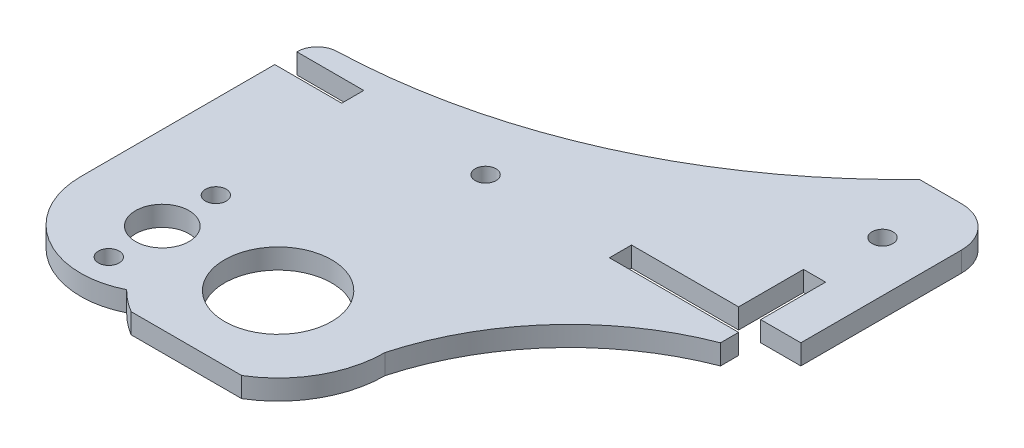
ISO-10303-21;
HEADER;
FILE_DESCRIPTION(('STEP AP214'),'2;1');
FILE_NAME('part.step','',(''),(''),'','','');
FILE_SCHEMA(('AUTOMOTIVE_DESIGN { 1 0 10303 214 1 1 1 1 }'));
ENDSEC;
DATA;
#1=APPLICATION_CONTEXT('core data for automotive mechanical design processes');
#2=APPLICATION_PROTOCOL_DEFINITION('international standard','automotive_design',2000,#1);
#3=PRODUCT_CONTEXT('',#1,'mechanical');
#4=PRODUCT('Part','Part','',(#3));
#5=PRODUCT_RELATED_PRODUCT_CATEGORY('part','',(#4));
#6=PRODUCT_DEFINITION_FORMATION('','',#4);
#7=PRODUCT_DEFINITION_CONTEXT('part definition',#1,'design');
#8=PRODUCT_DEFINITION('design','',#6,#7);
#9=PRODUCT_DEFINITION_SHAPE('','',#8);
#10=(LENGTH_UNIT() NAMED_UNIT(*) SI_UNIT(.MILLI.,.METRE.));
#11=(NAMED_UNIT(*) PLANE_ANGLE_UNIT() SI_UNIT($,.RADIAN.));
#12=(NAMED_UNIT(*) SI_UNIT($,.STERADIAN.) SOLID_ANGLE_UNIT());
#13=UNCERTAINTY_MEASURE_WITH_UNIT(LENGTH_MEASURE(1.E-05),#10,'distance_accuracy_value','');
#14=(GEOMETRIC_REPRESENTATION_CONTEXT(3) GLOBAL_UNCERTAINTY_ASSIGNED_CONTEXT((#13)) GLOBAL_UNIT_ASSIGNED_CONTEXT((#10,
#11,#12)) REPRESENTATION_CONTEXT('',''));
#15=CARTESIAN_POINT('',(0.,0.,0.));
#16=DIRECTION('',(0.,0.,1.));
#17=DIRECTION('',(1.,0.,0.));
#18=AXIS2_PLACEMENT_3D('',#15,#16,#17);
#19=CARTESIAN_POINT('',(0.,3.,4.));
#20=DIRECTION('',(0.,0.,-1.));
#21=DIRECTION('',(-1.,0.,0.));
#22=AXIS2_PLACEMENT_3D('',#19,#20,#21);
#23=PLANE('',#22);
#24=DIRECTION('',(0.,1.,0.));
#25=VECTOR('',#24,1.);
#26=CARTESIAN_POINT('',(37.7649863883907,-109.718638790317,4.));
#27=LINE('',#26,#25);
#28=CARTESIAN_POINT('',(37.7649863883907,0.,4.));
#29=VERTEX_POINT('',#28);
#30=CARTESIAN_POINT('',(37.7649863883907,3.,4.));
#31=VERTEX_POINT('',#30);
#32=EDGE_CURVE('E335',#29,#31,#27,.T.);
#33=ORIENTED_EDGE('',*,*,#32,.T.);
#34=DIRECTION('',(1.,0.,0.));
#35=VECTOR('',#34,1.);
#36=CARTESIAN_POINT('',(0.,3.,4.));
#37=LINE('',#36,#35);
#38=CARTESIAN_POINT('',(21.2350136116387,3.,4.));
#39=VERTEX_POINT('',#38);
#40=EDGE_CURVE('E333',#39,#31,#37,.T.);
#41=ORIENTED_EDGE('',*,*,#40,.F.);
#42=DIRECTION('',(0.,1.,0.));
#43=VECTOR('',#42,1.);
#44=CARTESIAN_POINT('',(21.2350136116387,-109.718638790317,4.));
#45=LINE('',#44,#43);
#46=CARTESIAN_POINT('',(21.2350136116387,0.,4.));
#47=VERTEX_POINT('',#46);
#48=EDGE_CURVE('E336',#47,#39,#45,.T.);
#49=ORIENTED_EDGE('',*,*,#48,.F.);
#50=DIRECTION('',(1.,0.,0.));
#51=VECTOR('',#50,1.);
#52=CARTESIAN_POINT('',(0.,0.,4.));
#53=LINE('',#52,#51);
#54=EDGE_CURVE('E436',#47,#29,#53,.T.);
#55=ORIENTED_EDGE('',*,*,#54,.T.);
#56=EDGE_LOOP('',(#33,#41,#49,#55));
#57=FACE_BOUND('',#56,.T.);
#58=ADVANCED_FACE('F115',(#57),#23,.F.);
#59=CARTESIAN_POINT('',(69.3,3.,0.));
#60=DIRECTION('',(-1.,0.,0.));
#61=DIRECTION('',(0.,0.,1.));
#62=AXIS2_PLACEMENT_3D('',#59,#60,#61);
#63=PLANE('',#62);
#64=DIRECTION('',(0.,1.,0.));
#65=VECTOR('',#64,1.);
#66=CARTESIAN_POINT('',(69.3,-109.718638790317,-36.));
#67=LINE('',#66,#65);
#68=CARTESIAN_POINT('',(69.3,0.,-36.));
#69=VERTEX_POINT('',#68);
#70=CARTESIAN_POINT('',(69.3,3.,-36.));
#71=VERTEX_POINT('',#70);
#72=EDGE_CURVE('E319',#69,#71,#67,.T.);
#73=ORIENTED_EDGE('',*,*,#72,.F.);
#74=DIRECTION('',(0.,0.,-1.));
#75=VECTOR('',#74,1.);
#76=CARTESIAN_POINT('',(69.3,0.,0.));
#77=LINE('',#76,#75);
#78=CARTESIAN_POINT('',(69.3,0.,-38.7));
#79=VERTEX_POINT('',#78);
#80=EDGE_CURVE('E491',#69,#79,#77,.T.);
#81=ORIENTED_EDGE('',*,*,#80,.T.);
#82=DIRECTION('',(0.,-1.,0.));
#83=VECTOR('',#82,1.);
#84=CARTESIAN_POINT('',(69.3,3.,-38.7));
#85=LINE('',#84,#83);
#86=CARTESIAN_POINT('',(69.3,3.,-38.7));
#87=VERTEX_POINT('',#86);
#88=EDGE_CURVE('E576',#87,#79,#85,.T.);
#89=ORIENTED_EDGE('',*,*,#88,.F.);
#90=DIRECTION('',(0.,0.,-1.));
#91=VECTOR('',#90,1.);
#92=CARTESIAN_POINT('',(69.3,3.,0.));
#93=LINE('',#92,#91);
#94=EDGE_CURVE('E445',#71,#87,#93,.T.);
#95=ORIENTED_EDGE('',*,*,#94,.F.);
#96=EDGE_LOOP('',(#73,#81,#89,#95));
#97=FACE_BOUND('',#96,.T.);
#98=ADVANCED_FACE('F632',(#97),#63,.F.);
#99=CARTESIAN_POINT('',(0.,3.,-72.));
#100=DIRECTION('',(0.,0.,1.));
#101=DIRECTION('',(1.,0.,0.));
#102=AXIS2_PLACEMENT_3D('',#99,#100,#101);
#103=PLANE('',#102);
#104=DIRECTION('',(-1.,0.,0.));
#105=VECTOR('',#104,1.);
#106=CARTESIAN_POINT('',(69.3,3.,-72.));
#107=LINE('',#106,#105);
#108=CARTESIAN_POINT('',(69.3,3.,-72.));
#109=VERTEX_POINT('',#108);
#110=CARTESIAN_POINT('',(63.0000000000033,3.,-72.));
#111=VERTEX_POINT('',#110);
#112=EDGE_CURVE('E473',#109,#111,#107,.T.);
#113=ORIENTED_EDGE('',*,*,#112,.F.);
#114=DIRECTION('',(0.,-1.,0.));
#115=VECTOR('',#114,1.);
#116=CARTESIAN_POINT('',(69.3,3.,-72.));
#117=LINE('',#116,#115);
#118=CARTESIAN_POINT('',(69.3,0.,-72.));
#119=VERTEX_POINT('',#118);
#120=EDGE_CURVE('E580',#109,#119,#117,.T.);
#121=ORIENTED_EDGE('',*,*,#120,.T.);
#122=DIRECTION('',(-1.,0.,0.));
#123=VECTOR('',#122,1.);
#124=CARTESIAN_POINT('',(0.,0.,-72.));
#125=LINE('',#124,#123);
#126=CARTESIAN_POINT('',(63.0000000000033,0.,-72.));
#127=VERTEX_POINT('',#126);
#128=EDGE_CURVE('E518',#119,#127,#125,.T.);
#129=ORIENTED_EDGE('',*,*,#128,.T.);
#130=DIRECTION('',(0.,1.,0.));
#131=VECTOR('',#130,1.);
#132=CARTESIAN_POINT('',(63.0000000000033,-109.718638790317,-72.));
#133=LINE('',#132,#131);
#134=EDGE_CURVE('E361',#127,#111,#133,.T.);
#135=ORIENTED_EDGE('',*,*,#134,.T.);
#136=EDGE_LOOP('',(#113,#121,#129,#135));
#137=FACE_BOUND('',#136,.T.);
#138=ADVANCED_FACE('F637',(#137),#103,.F.);
#139=CARTESIAN_POINT('',(0.,3.,-42.));
#140=DIRECTION('',(1.,0.,0.));
#141=DIRECTION('',(0.,0.,-1.));
#142=AXIS2_PLACEMENT_3D('',#139,#140,#141);
#143=PLANE('',#142);
#144=DIRECTION('',(0.,0.,1.));
#145=VECTOR('',#144,1.);
#146=CARTESIAN_POINT('',(0.,3.,-42.));
#147=LINE('',#146,#145);
#148=CARTESIAN_POINT('',(0.,3.,-42.0500138966103));
#149=VERTEX_POINT('',#148);
#150=CARTESIAN_POINT('',(0.,3.,-42.));
#151=VERTEX_POINT('',#150);
#152=EDGE_CURVE('E475',#149,#151,#147,.T.);
#153=ORIENTED_EDGE('',*,*,#152,.F.);
#154=DIRECTION('',(0.,-1.,0.));
#155=VECTOR('',#154,1.);
#156=CARTESIAN_POINT('',(0.,0.,-42.0500138966103));
#157=LINE('',#156,#155);
#158=CARTESIAN_POINT('',(0.,0.,-42.0500138966103));
#159=VERTEX_POINT('',#158);
#160=EDGE_CURVE('E124',#149,#159,#157,.T.);
#161=ORIENTED_EDGE('',*,*,#160,.T.);
#162=DIRECTION('',(0.,0.,1.));
#163=VECTOR('',#162,1.);
#164=CARTESIAN_POINT('',(0.,0.,-42.));
#165=LINE('',#164,#163);
#166=CARTESIAN_POINT('',(0.,0.,-42.));
#167=VERTEX_POINT('',#166);
#168=EDGE_CURVE('E521',#159,#167,#165,.T.);
#169=ORIENTED_EDGE('',*,*,#168,.T.);
#170=DIRECTION('',(0.,-1.,0.));
#171=VECTOR('',#170,1.);
#172=CARTESIAN_POINT('',(0.,3.,-42.));
#173=LINE('',#172,#171);
#174=EDGE_CURVE('E545',#151,#167,#173,.T.);
#175=ORIENTED_EDGE('',*,*,#174,.F.);
#176=EDGE_LOOP('',(#153,#161,#169,#175));
#177=FACE_BOUND('',#176,.T.);
#178=ADVANCED_FACE('F608',(#177),#143,.F.);
#179=CARTESIAN_POINT('',(0.,3.,0.));
#180=DIRECTION('',(0.,1.,0.));
#181=DIRECTION('',(0.,0.,1.));
#182=AXIS2_PLACEMENT_3D('',#179,#180,#181);
#183=PLANE('',#182);
#184=CARTESIAN_POINT('',(29.5000000000125,3.,-9.69999999999992));
#185=DIRECTION('',(0.,1.,0.));
#186=DIRECTION('',(0.,0.,1.));
#187=AXIS2_PLACEMENT_3D('',#184,#185,#186);
#188=CIRCLE('',#187,8.);
#189=CARTESIAN_POINT('',(29.5000000000125,3.,-1.69999999999992));
#190=VERTEX_POINT('',#189);
#191=EDGE_CURVE('E395',#190,#190,#188,.T.);
#192=ORIENTED_EDGE('',*,*,#191,.F.);
#193=EDGE_LOOP('',(#192));
#194=FACE_BOUND('',#193,.T.);
#195=CARTESIAN_POINT('',(12.5,3.,-17.4));
#196=DIRECTION('',(0.,1.,0.));
#197=DIRECTION('',(0.,0.,1.));
#198=AXIS2_PLACEMENT_3D('',#195,#196,#197);
#199=CIRCLE('',#198,1.55);
#200=CARTESIAN_POINT('',(12.5,3.,-15.85));
#201=VERTEX_POINT('',#200);
#202=EDGE_CURVE('E405',#201,#201,#199,.T.);
#203=ORIENTED_EDGE('',*,*,#202,.F.);
#204=EDGE_LOOP('',(#203));
#205=FACE_BOUND('',#204,.T.);
#206=CARTESIAN_POINT('',(12.5,3.,-1.4));
#207=DIRECTION('',(0.,1.,0.));
#208=DIRECTION('',(0.,0.,1.));
#209=AXIS2_PLACEMENT_3D('',#206,#207,#208);
#210=CIRCLE('',#209,1.55);
#211=CARTESIAN_POINT('',(12.5,3.,0.150000000000001));
#212=VERTEX_POINT('',#211);
#213=EDGE_CURVE('E379',#212,#212,#210,.T.);
#214=ORIENTED_EDGE('',*,*,#213,.F.);
#215=EDGE_LOOP('',(#214));
#216=FACE_BOUND('',#215,.T.);
#217=CARTESIAN_POINT('',(67.8,3.,-61.7));
#218=DIRECTION('',(0.,1.,0.));
#219=DIRECTION('',(0.,0.,1.));
#220=AXIS2_PLACEMENT_3D('',#217,#218,#219);
#221=CIRCLE('',#220,1.54999999999999);
#222=CARTESIAN_POINT('',(67.8,3.,-60.15));
#223=VERTEX_POINT('',#222);
#224=EDGE_CURVE('E426',#223,#223,#221,.T.);
#225=ORIENTED_EDGE('',*,*,#224,.F.);
#226=EDGE_LOOP('',(#225));
#227=FACE_BOUND('',#226,.T.);
#228=CARTESIAN_POINT('',(0.,3.,-132.000000000008));
#229=DIRECTION('',(0.,1.,0.));
#230=DIRECTION('',(0.,0.,1.));
#231=AXIS2_PLACEMENT_3D('',#228,#229,#230);
#232=CIRCLE('',#231,87.0000000000078);
#233=CARTESIAN_POINT('',(2.90000000000001,3.,-45.0483467667233));
#234=VERTEX_POINT('',#233);
#235=EDGE_CURVE('E366',#111,#234,#232,.F.);
#236=ORIENTED_EDGE('',*,*,#235,.T.);
#237=CARTESIAN_POINT('',(3.,3.,-42.0500138966103));
#238=DIRECTION('',(0.,1.,0.));
#239=DIRECTION('',(0.,0.,1.));
#240=AXIS2_PLACEMENT_3D('',#237,#238,#239);
#241=CIRCLE('',#240,3.);
#242=EDGE_CURVE('E144',#234,#149,#241,.T.);
#243=ORIENTED_EDGE('',*,*,#242,.T.);
#244=ORIENTED_EDGE('',*,*,#152,.T.);
#245=DIRECTION('',(1.,0.,0.));
#246=VECTOR('',#245,1.);
#247=CARTESIAN_POINT('',(0.,3.,-42.));
#248=LINE('',#247,#246);
#249=CARTESIAN_POINT('',(10.,3.,-42.));
#250=VERTEX_POINT('',#249);
#251=EDGE_CURVE('E478',#151,#250,#248,.T.);
#252=ORIENTED_EDGE('',*,*,#251,.T.);
#253=DIRECTION('',(0.,0.,1.));
#254=VECTOR('',#253,1.);
#255=CARTESIAN_POINT('',(10.,3.,-38.7));
#256=LINE('',#255,#254);
#257=CARTESIAN_POINT('',(10.,3.,-38.7));
#258=VERTEX_POINT('',#257);
#259=EDGE_CURVE('E481',#250,#258,#256,.T.);
#260=ORIENTED_EDGE('',*,*,#259,.T.);
#261=DIRECTION('',(-1.,0.,0.));
#262=VECTOR('',#261,1.);
#263=CARTESIAN_POINT('',(0.,3.,-38.7));
#264=LINE('',#263,#262);
#265=CARTESIAN_POINT('',(0.,3.,-38.7));
#266=VERTEX_POINT('',#265);
#267=EDGE_CURVE('E484',#258,#266,#264,.T.);
#268=ORIENTED_EDGE('',*,*,#267,.T.);
#269=DIRECTION('',(0.,0.,1.));
#270=VECTOR('',#269,1.);
#271=CARTESIAN_POINT('',(0.,3.,0.));
#272=LINE('',#271,#270);
#273=CARTESIAN_POINT('',(0.,3.,-9.700000000001));
#274=VERTEX_POINT('',#273);
#275=EDGE_CURVE('E440',#266,#274,#272,.T.);
#276=ORIENTED_EDGE('',*,*,#275,.T.);
#277=CARTESIAN_POINT('',(12.5000000000129,3.,-9.700000000001));
#278=DIRECTION('',(0.,1.,0.));
#279=DIRECTION('',(0.,0.,1.));
#280=AXIS2_PLACEMENT_3D('',#277,#278,#279);
#281=CIRCLE('',#280,12.5000000000129);
#282=CARTESIAN_POINT('',(18.0661764706096,3.,1.49230447666955));
#283=VERTEX_POINT('',#282);
#284=EDGE_CURVE('E354',#274,#283,#281,.T.);
#285=ORIENTED_EDGE('',*,*,#284,.T.);
#286=CARTESIAN_POINT('',(29.5000000000125,3.,-9.69999999999992));
#287=DIRECTION('',(0.,1.,0.));
#288=DIRECTION('',(0.,0.,1.));
#289=AXIS2_PLACEMENT_3D('',#286,#287,#288);
#290=CIRCLE('',#289,16.);
#291=EDGE_CURVE('E338',#283,#39,#290,.T.);
#292=ORIENTED_EDGE('',*,*,#291,.T.);
#293=ORIENTED_EDGE('',*,*,#40,.T.);
#294=CARTESIAN_POINT('',(45.5000000000125,3.,-9.69999999999992));
#295=VERTEX_POINT('',#294);
#296=EDGE_CURVE('E312',#31,#295,#290,.T.);
#297=ORIENTED_EDGE('',*,*,#296,.T.);
#298=CARTESIAN_POINT('',(83.4995829871577,3.,0.768634033987765));
#299=DIRECTION('',(0.,1.,0.));
#300=DIRECTION('',(0.,0.,1.));
#301=AXIS2_PLACEMENT_3D('',#298,#299,#300);
#302=CIRCLE('',#301,39.4152331685923);
#303=EDGE_CURVE('E320',#295,#71,#302,.F.);
#304=ORIENTED_EDGE('',*,*,#303,.T.);
#305=ORIENTED_EDGE('',*,*,#94,.T.);
#306=DIRECTION('',(-1.,0.,0.));
#307=VECTOR('',#306,1.);
#308=CARTESIAN_POINT('',(69.3,3.,-38.7));
#309=LINE('',#308,#307);
#310=CARTESIAN_POINT('',(50.,3.,-38.7));
#311=VERTEX_POINT('',#310);
#312=EDGE_CURVE('E448',#87,#311,#309,.T.);
#313=ORIENTED_EDGE('',*,*,#312,.T.);
#314=DIRECTION('',(0.,0.,-1.));
#315=VECTOR('',#314,1.);
#316=CARTESIAN_POINT('',(50.,3.,-38.7));
#317=LINE('',#316,#315);
#318=CARTESIAN_POINT('',(50.,3.,-42.));
#319=VERTEX_POINT('',#318);
#320=EDGE_CURVE('E451',#311,#319,#317,.T.);
#321=ORIENTED_EDGE('',*,*,#320,.T.);
#322=DIRECTION('',(1.,0.,0.));
#323=VECTOR('',#322,1.);
#324=CARTESIAN_POINT('',(66.,3.,-42.));
#325=LINE('',#324,#323);
#326=CARTESIAN_POINT('',(66.,3.,-42.));
#327=VERTEX_POINT('',#326);
#328=EDGE_CURVE('E454',#319,#327,#325,.T.);
#329=ORIENTED_EDGE('',*,*,#328,.T.);
#330=DIRECTION('',(0.,0.,-1.));
#331=VECTOR('',#330,1.);
#332=CARTESIAN_POINT('',(66.,3.,-42.));
#333=LINE('',#332,#331);
#334=CARTESIAN_POINT('',(66.,3.,-51.7));
#335=VERTEX_POINT('',#334);
#336=EDGE_CURVE('E457',#327,#335,#333,.T.);
#337=ORIENTED_EDGE('',*,*,#336,.T.);
#338=DIRECTION('',(1.,0.,0.));
#339=VECTOR('',#338,1.);
#340=CARTESIAN_POINT('',(69.3,3.,-51.7));
#341=LINE('',#340,#339);
#342=CARTESIAN_POINT('',(69.3,3.,-51.7));
#343=VERTEX_POINT('',#342);
#344=EDGE_CURVE('E460',#335,#343,#341,.T.);
#345=ORIENTED_EDGE('',*,*,#344,.T.);
#346=DIRECTION('',(0.,0.,1.));
#347=VECTOR('',#346,1.);
#348=CARTESIAN_POINT('',(69.3,3.,-51.7));
#349=LINE('',#348,#347);
#350=CARTESIAN_POINT('',(69.3,3.,-42.));
#351=VERTEX_POINT('',#350);
#352=EDGE_CURVE('E463',#343,#351,#349,.T.);
#353=ORIENTED_EDGE('',*,*,#352,.T.);
#354=DIRECTION('',(1.,0.,0.));
#355=VECTOR('',#354,1.);
#356=CARTESIAN_POINT('',(69.3,3.,-42.));
#357=LINE('',#356,#355);
#358=CARTESIAN_POINT('',(75.3,3.,-42.));
#359=VERTEX_POINT('',#358);
#360=EDGE_CURVE('E466',#351,#359,#357,.T.);
#361=ORIENTED_EDGE('',*,*,#360,.T.);
#362=DIRECTION('',(0.,0.,-1.));
#363=VECTOR('',#362,1.);
#364=CARTESIAN_POINT('',(75.3,3.,-52.));
#365=LINE('',#364,#363);
#366=CARTESIAN_POINT('',(75.3,3.,-66.));
#367=VERTEX_POINT('',#366);
#368=EDGE_CURVE('E469',#359,#367,#365,.T.);
#369=ORIENTED_EDGE('',*,*,#368,.T.);
#370=CARTESIAN_POINT('',(69.3,3.,-66.));
#371=DIRECTION('',(0.,1.,0.));
#372=DIRECTION('',(0.,0.,1.));
#373=AXIS2_PLACEMENT_3D('',#370,#371,#372);
#374=CIRCLE('',#373,6.);
#375=EDGE_CURVE('E587',#367,#109,#374,.T.);
#376=ORIENTED_EDGE('',*,*,#375,.T.);
#377=ORIENTED_EDGE('',*,*,#112,.T.);
#378=EDGE_LOOP('',(#236,#243,#244,#252,#260,#268,#276,#285,#292,#293,#297,#304,#305,#313,#321,
#329,#337,#345,#353,#361,#369,#376,#377));
#379=FACE_BOUND('',#378,.T.);
#380=CARTESIAN_POINT('',(30.,3.,-40.2));
#381=DIRECTION('',(0.,1.,0.));
#382=DIRECTION('',(0.,0.,1.));
#383=AXIS2_PLACEMENT_3D('',#380,#381,#382);
#384=CIRCLE('',#383,1.55);
#385=CARTESIAN_POINT('',(30.,3.,-38.65));
#386=VERTEX_POINT('',#385);
#387=EDGE_CURVE('E432',#386,#386,#384,.T.);
#388=ORIENTED_EDGE('',*,*,#387,.F.);
#389=EDGE_LOOP('',(#388));
#390=FACE_BOUND('',#389,.T.);
#391=CARTESIAN_POINT('',(12.5,3.,-9.4));
#392=DIRECTION('',(0.,1.,0.));
#393=DIRECTION('',(0.,0.,1.));
#394=AXIS2_PLACEMENT_3D('',#391,#392,#393);
#395=CIRCLE('',#394,4.);
#396=CARTESIAN_POINT('',(12.5,3.,-5.4));
#397=VERTEX_POINT('',#396);
#398=EDGE_CURVE('E418',#397,#397,#395,.T.);
#399=ORIENTED_EDGE('',*,*,#398,.F.);
#400=EDGE_LOOP('',(#399));
#401=FACE_BOUND('',#400,.T.);
#402=ADVANCED_FACE('F329',(#194,#205,#216,#227,#379,#390,#401),#183,.T.);
#403=CARTESIAN_POINT('',(0.,0.,0.));
#404=DIRECTION('',(0.,1.,0.));
#405=DIRECTION('',(0.,0.,1.));
#406=AXIS2_PLACEMENT_3D('',#403,#404,#405);
#407=PLANE('',#406);
#408=ORIENTED_EDGE('',*,*,#168,.F.);
#409=CARTESIAN_POINT('',(3.,0.,-42.0500138966103));
#410=DIRECTION('',(0.,1.,0.));
#411=DIRECTION('',(0.,0.,1.));
#412=AXIS2_PLACEMENT_3D('',#409,#410,#411);
#413=CIRCLE('',#412,3.);
#414=CARTESIAN_POINT('',(2.90000000000001,0.,-45.0483467667233));
#415=VERTEX_POINT('',#414);
#416=EDGE_CURVE('E13',#159,#415,#413,.F.);
#417=ORIENTED_EDGE('',*,*,#416,.T.);
#418=CARTESIAN_POINT('',(0.,0.,-132.000000000008));
#419=DIRECTION('',(0.,1.,0.));
#420=DIRECTION('',(0.,0.,1.));
#421=AXIS2_PLACEMENT_3D('',#418,#419,#420);
#422=CIRCLE('',#421,87.0000000000078);
#423=EDGE_CURVE('E380',#415,#127,#422,.T.);
#424=ORIENTED_EDGE('',*,*,#423,.T.);
#425=ORIENTED_EDGE('',*,*,#128,.F.);
#426=CARTESIAN_POINT('',(69.3,0.,-66.));
#427=DIRECTION('',(0.,1.,0.));
#428=DIRECTION('',(0.,0.,1.));
#429=AXIS2_PLACEMENT_3D('',#426,#427,#428);
#430=CIRCLE('',#429,6.);
#431=CARTESIAN_POINT('',(75.3,0.,-66.));
#432=VERTEX_POINT('',#431);
#433=EDGE_CURVE('E583',#119,#432,#430,.F.);
#434=ORIENTED_EDGE('',*,*,#433,.T.);
#435=DIRECTION('',(0.,0.,-1.));
#436=VECTOR('',#435,1.);
#437=CARTESIAN_POINT('',(75.3,0.,-72.));
#438=LINE('',#437,#436);
#439=CARTESIAN_POINT('',(75.3,0.,-42.));
#440=VERTEX_POINT('',#439);
#441=EDGE_CURVE('E514',#440,#432,#438,.T.);
#442=ORIENTED_EDGE('',*,*,#441,.F.);
#443=DIRECTION('',(1.,0.,0.));
#444=VECTOR('',#443,1.);
#445=CARTESIAN_POINT('',(69.3,0.,-42.));
#446=LINE('',#445,#444);
#447=CARTESIAN_POINT('',(69.3,0.,-42.));
#448=VERTEX_POINT('',#447);
#449=EDGE_CURVE('E510',#448,#440,#446,.T.);
#450=ORIENTED_EDGE('',*,*,#449,.F.);
#451=DIRECTION('',(0.,0.,1.));
#452=VECTOR('',#451,1.);
#453=CARTESIAN_POINT('',(69.3,0.,-51.7));
#454=LINE('',#453,#452);
#455=CARTESIAN_POINT('',(69.3,0.,-51.7));
#456=VERTEX_POINT('',#455);
#457=EDGE_CURVE('E507',#456,#448,#454,.T.);
#458=ORIENTED_EDGE('',*,*,#457,.F.);
#459=DIRECTION('',(1.,0.,0.));
#460=VECTOR('',#459,1.);
#461=CARTESIAN_POINT('',(69.3,0.,-51.7));
#462=LINE('',#461,#460);
#463=CARTESIAN_POINT('',(66.,0.,-51.7));
#464=VERTEX_POINT('',#463);
#465=EDGE_CURVE('E504',#464,#456,#462,.T.);
#466=ORIENTED_EDGE('',*,*,#465,.F.);
#467=DIRECTION('',(0.,0.,-1.));
#468=VECTOR('',#467,1.);
#469=CARTESIAN_POINT('',(66.,0.,-42.));
#470=LINE('',#469,#468);
#471=CARTESIAN_POINT('',(66.,0.,-42.));
#472=VERTEX_POINT('',#471);
#473=EDGE_CURVE('E501',#472,#464,#470,.T.);
#474=ORIENTED_EDGE('',*,*,#473,.F.);
#475=DIRECTION('',(1.,0.,0.));
#476=VECTOR('',#475,1.);
#477=CARTESIAN_POINT('',(66.,0.,-42.));
#478=LINE('',#477,#476);
#479=CARTESIAN_POINT('',(50.,0.,-42.));
#480=VERTEX_POINT('',#479);
#481=EDGE_CURVE('E499',#480,#472,#478,.T.);
#482=ORIENTED_EDGE('',*,*,#481,.F.);
#483=DIRECTION('',(0.,0.,-1.));
#484=VECTOR('',#483,1.);
#485=CARTESIAN_POINT('',(50.,0.,-38.7));
#486=LINE('',#485,#484);
#487=CARTESIAN_POINT('',(50.,0.,-38.7));
#488=VERTEX_POINT('',#487);
#489=EDGE_CURVE('E496',#488,#480,#486,.T.);
#490=ORIENTED_EDGE('',*,*,#489,.F.);
#491=DIRECTION('',(-1.,0.,0.));
#492=VECTOR('',#491,1.);
#493=CARTESIAN_POINT('',(69.3,0.,-38.7));
#494=LINE('',#493,#492);
#495=EDGE_CURVE('E493',#79,#488,#494,.T.);
#496=ORIENTED_EDGE('',*,*,#495,.F.);
#497=ORIENTED_EDGE('',*,*,#80,.F.);
#498=CARTESIAN_POINT('',(83.4995829871577,0.,0.768634033987765));
#499=DIRECTION('',(0.,1.,0.));
#500=DIRECTION('',(0.,0.,1.));
#501=AXIS2_PLACEMENT_3D('',#498,#499,#500);
#502=CIRCLE('',#501,39.4152331685923);
#503=CARTESIAN_POINT('',(45.5000000000125,0.,-9.69999999999992));
#504=VERTEX_POINT('',#503);
#505=EDGE_CURVE('E376',#69,#504,#502,.T.);
#506=ORIENTED_EDGE('',*,*,#505,.T.);
#507=CARTESIAN_POINT('',(29.5000000000125,0.,-9.69999999999992));
#508=DIRECTION('',(0.,1.,0.));
#509=DIRECTION('',(0.,0.,1.));
#510=AXIS2_PLACEMENT_3D('',#507,#508,#509);
#511=CIRCLE('',#510,16.);
#512=EDGE_CURVE('E315',#504,#29,#511,.F.);
#513=ORIENTED_EDGE('',*,*,#512,.T.);
#514=ORIENTED_EDGE('',*,*,#54,.F.);
#515=CARTESIAN_POINT('',(29.5000000000125,0.,-9.69999999999992));
#516=DIRECTION('',(0.,1.,0.));
#517=DIRECTION('',(0.,0.,1.));
#518=AXIS2_PLACEMENT_3D('',#515,#516,#517);
#519=CIRCLE('',#518,16.);
#520=CARTESIAN_POINT('',(18.0661764706096,0.,1.49230447666955));
#521=VERTEX_POINT('',#520);
#522=EDGE_CURVE('E386',#47,#521,#519,.F.);
#523=ORIENTED_EDGE('',*,*,#522,.T.);
#524=CARTESIAN_POINT('',(12.5000000000129,0.,-9.700000000001));
#525=DIRECTION('',(0.,1.,0.));
#526=DIRECTION('',(0.,0.,1.));
#527=AXIS2_PLACEMENT_3D('',#524,#525,#526);
#528=CIRCLE('',#527,12.5000000000129);
#529=CARTESIAN_POINT('',(0.,0.,-9.70000000000094));
#530=VERTEX_POINT('',#529);
#531=EDGE_CURVE('E382',#521,#530,#528,.F.);
#532=ORIENTED_EDGE('',*,*,#531,.T.);
#533=DIRECTION('',(0.,0.,1.));
#534=VECTOR('',#533,1.);
#535=CARTESIAN_POINT('',(0.,0.,0.));
#536=LINE('',#535,#534);
#537=CARTESIAN_POINT('',(0.,0.,-38.7));
#538=VERTEX_POINT('',#537);
#539=EDGE_CURVE('E442',#538,#530,#536,.T.);
#540=ORIENTED_EDGE('',*,*,#539,.F.);
#541=DIRECTION('',(-1.,0.,0.));
#542=VECTOR('',#541,1.);
#543=CARTESIAN_POINT('',(0.,0.,-38.7));
#544=LINE('',#543,#542);
#545=CARTESIAN_POINT('',(10.,0.,-38.7));
#546=VERTEX_POINT('',#545);
#547=EDGE_CURVE('E530',#546,#538,#544,.T.);
#548=ORIENTED_EDGE('',*,*,#547,.F.);
#549=DIRECTION('',(0.,0.,1.));
#550=VECTOR('',#549,1.);
#551=CARTESIAN_POINT('',(10.,0.,-38.7));
#552=LINE('',#551,#550);
#553=CARTESIAN_POINT('',(10.,0.,-42.));
#554=VERTEX_POINT('',#553);
#555=EDGE_CURVE('E527',#554,#546,#552,.T.);
#556=ORIENTED_EDGE('',*,*,#555,.F.);
#557=DIRECTION('',(1.,0.,0.));
#558=VECTOR('',#557,1.);
#559=CARTESIAN_POINT('',(0.,0.,-42.));
#560=LINE('',#559,#558);
#561=EDGE_CURVE('E524',#167,#554,#560,.T.);
#562=ORIENTED_EDGE('',*,*,#561,.F.);
#563=EDGE_LOOP('',(#408,#417,#424,#425,#434,#442,#450,#458,#466,#474,#482,#490,#496,#497,#506,
#513,#514,#523,#532,#540,#548,#556,#562));
#564=FACE_BOUND('',#563,.T.);
#565=CARTESIAN_POINT('',(29.5000000000125,0.,-9.69999999999992));
#566=DIRECTION('',(0.,1.,0.));
#567=DIRECTION('',(0.,0.,1.));
#568=AXIS2_PLACEMENT_3D('',#565,#566,#567);
#569=CIRCLE('',#568,8.);
#570=CARTESIAN_POINT('',(29.5000000000125,0.,-1.69999999999992));
#571=VERTEX_POINT('',#570);
#572=EDGE_CURVE('E399',#571,#571,#569,.F.);
#573=ORIENTED_EDGE('',*,*,#572,.F.);
#574=EDGE_LOOP('',(#573));
#575=FACE_BOUND('',#574,.T.);
#576=CARTESIAN_POINT('',(12.5,0.,-17.4));
#577=DIRECTION('',(0.,1.,0.));
#578=DIRECTION('',(0.,0.,1.));
#579=AXIS2_PLACEMENT_3D('',#576,#577,#578);
#580=CIRCLE('',#579,1.55);
#581=CARTESIAN_POINT('',(12.5,0.,-15.85));
#582=VERTEX_POINT('',#581);
#583=EDGE_CURVE('E400',#582,#582,#580,.F.);
#584=ORIENTED_EDGE('',*,*,#583,.F.);
#585=EDGE_LOOP('',(#584));
#586=FACE_BOUND('',#585,.T.);
#587=CARTESIAN_POINT('',(12.5,0.,-1.4));
#588=DIRECTION('',(0.,1.,0.));
#589=DIRECTION('',(0.,0.,1.));
#590=AXIS2_PLACEMENT_3D('',#587,#588,#589);
#591=CIRCLE('',#590,1.55);
#592=CARTESIAN_POINT('',(12.5,0.,0.150000000000001));
#593=VERTEX_POINT('',#592);
#594=EDGE_CURVE('E409',#593,#593,#591,.F.);
#595=ORIENTED_EDGE('',*,*,#594,.F.);
#596=EDGE_LOOP('',(#595));
#597=FACE_BOUND('',#596,.T.);
#598=CARTESIAN_POINT('',(30.,0.,-40.2));
#599=DIRECTION('',(0.,1.,0.));
#600=DIRECTION('',(0.,0.,1.));
#601=AXIS2_PLACEMENT_3D('',#598,#599,#600);
#602=CIRCLE('',#601,1.55);
#603=CARTESIAN_POINT('',(30.,0.,-38.65));
#604=VERTEX_POINT('',#603);
#605=EDGE_CURVE('E429',#604,#604,#602,.T.);
#606=ORIENTED_EDGE('',*,*,#605,.T.);
#607=EDGE_LOOP('',(#606));
#608=FACE_BOUND('',#607,.T.);
#609=CARTESIAN_POINT('',(67.8,0.,-61.7));
#610=DIRECTION('',(0.,1.,0.));
#611=DIRECTION('',(0.,0.,1.));
#612=AXIS2_PLACEMENT_3D('',#609,#610,#611);
#613=CIRCLE('',#612,1.54999999999999);
#614=CARTESIAN_POINT('',(67.8,0.,-60.15));
#615=VERTEX_POINT('',#614);
#616=EDGE_CURVE('E422',#615,#615,#613,.T.);
#617=ORIENTED_EDGE('',*,*,#616,.T.);
#618=EDGE_LOOP('',(#617));
#619=FACE_BOUND('',#618,.T.);
#620=CARTESIAN_POINT('',(12.5,0.,-9.4));
#621=DIRECTION('',(0.,1.,0.));
#622=DIRECTION('',(0.,0.,1.));
#623=AXIS2_PLACEMENT_3D('',#620,#621,#622);
#624=CIRCLE('',#623,4.);
#625=CARTESIAN_POINT('',(12.5,0.,-5.4));
#626=VERTEX_POINT('',#625);
#627=EDGE_CURVE('E404',#626,#626,#624,.T.);
#628=ORIENTED_EDGE('',*,*,#627,.T.);
#629=EDGE_LOOP('',(#628));
#630=FACE_BOUND('',#629,.T.);
#631=ADVANCED_FACE('F602',(#564,#575,#586,#597,#608,#619,#630),#407,.F.);
#632=CARTESIAN_POINT('',(69.3,3.,-38.7));
#633=DIRECTION('',(0.,0.,1.));
#634=DIRECTION('',(1.,0.,0.));
#635=AXIS2_PLACEMENT_3D('',#632,#633,#634);
#636=PLANE('',#635);
#637=ORIENTED_EDGE('',*,*,#495,.T.);
#638=DIRECTION('',(0.,-1.,0.));
#639=VECTOR('',#638,1.);
#640=CARTESIAN_POINT('',(50.,3.,-38.7));
#641=LINE('',#640,#639);
#642=EDGE_CURVE('E572',#311,#488,#641,.T.);
#643=ORIENTED_EDGE('',*,*,#642,.F.);
#644=ORIENTED_EDGE('',*,*,#312,.F.);
#645=ORIENTED_EDGE('',*,*,#88,.T.);
#646=EDGE_LOOP('',(#637,#643,#644,#645));
#647=FACE_BOUND('',#646,.T.);
#648=ADVANCED_FACE('F691',(#647),#636,.F.);
#649=CARTESIAN_POINT('',(50.,3.,-38.7));
#650=DIRECTION('',(-1.,0.,0.));
#651=DIRECTION('',(0.,0.,1.));
#652=AXIS2_PLACEMENT_3D('',#649,#650,#651);
#653=PLANE('',#652);
#654=ORIENTED_EDGE('',*,*,#489,.T.);
#655=DIRECTION('',(0.,-1.,0.));
#656=VECTOR('',#655,1.);
#657=CARTESIAN_POINT('',(50.,3.,-42.));
#658=LINE('',#657,#656);
#659=EDGE_CURVE('E568',#319,#480,#658,.T.);
#660=ORIENTED_EDGE('',*,*,#659,.F.);
#661=ORIENTED_EDGE('',*,*,#320,.F.);
#662=ORIENTED_EDGE('',*,*,#642,.T.);
#663=EDGE_LOOP('',(#654,#660,#661,#662));
#664=FACE_BOUND('',#663,.T.);
#665=ADVANCED_FACE('F687',(#664),#653,.F.);
#666=CARTESIAN_POINT('',(66.,3.,-42.));
#667=DIRECTION('',(0.,0.,-1.));
#668=DIRECTION('',(-1.,0.,0.));
#669=AXIS2_PLACEMENT_3D('',#666,#667,#668);
#670=PLANE('',#669);
#671=ORIENTED_EDGE('',*,*,#481,.T.);
#672=DIRECTION('',(0.,-1.,0.));
#673=VECTOR('',#672,1.);
#674=CARTESIAN_POINT('',(66.,3.,-42.));
#675=LINE('',#674,#673);
#676=EDGE_CURVE('E564',#327,#472,#675,.T.);
#677=ORIENTED_EDGE('',*,*,#676,.F.);
#678=ORIENTED_EDGE('',*,*,#328,.F.);
#679=ORIENTED_EDGE('',*,*,#659,.T.);
#680=EDGE_LOOP('',(#671,#677,#678,#679));
#681=FACE_BOUND('',#680,.T.);
#682=ADVANCED_FACE('F682',(#681),#670,.F.);
#683=CARTESIAN_POINT('',(66.,3.,-42.));
#684=DIRECTION('',(-1.,0.,0.));
#685=DIRECTION('',(0.,0.,1.));
#686=AXIS2_PLACEMENT_3D('',#683,#684,#685);
#687=PLANE('',#686);
#688=ORIENTED_EDGE('',*,*,#473,.T.);
#689=DIRECTION('',(0.,-1.,0.));
#690=VECTOR('',#689,1.);
#691=CARTESIAN_POINT('',(66.,3.,-51.7));
#692=LINE('',#691,#690);
#693=EDGE_CURVE('E560',#335,#464,#692,.T.);
#694=ORIENTED_EDGE('',*,*,#693,.F.);
#695=ORIENTED_EDGE('',*,*,#336,.F.);
#696=ORIENTED_EDGE('',*,*,#676,.T.);
#697=EDGE_LOOP('',(#688,#694,#695,#696));
#698=FACE_BOUND('',#697,.T.);
#699=ADVANCED_FACE('F676',(#698),#687,.F.);
#700=CARTESIAN_POINT('',(69.3,3.,-51.7));
#701=DIRECTION('',(0.,0.,-1.));
#702=DIRECTION('',(-1.,0.,0.));
#703=AXIS2_PLACEMENT_3D('',#700,#701,#702);
#704=PLANE('',#703);
#705=ORIENTED_EDGE('',*,*,#465,.T.);
#706=DIRECTION('',(0.,-1.,0.));
#707=VECTOR('',#706,1.);
#708=CARTESIAN_POINT('',(69.3,3.,-51.7));
#709=LINE('',#708,#707);
#710=EDGE_CURVE('E556',#343,#456,#709,.T.);
#711=ORIENTED_EDGE('',*,*,#710,.F.);
#712=ORIENTED_EDGE('',*,*,#344,.F.);
#713=ORIENTED_EDGE('',*,*,#693,.T.);
#714=EDGE_LOOP('',(#705,#711,#712,#713));
#715=FACE_BOUND('',#714,.T.);
#716=ADVANCED_FACE('F672',(#715),#704,.F.);
#717=CARTESIAN_POINT('',(69.3,3.,-51.7));
#718=DIRECTION('',(1.,0.,0.));
#719=DIRECTION('',(0.,0.,-1.));
#720=AXIS2_PLACEMENT_3D('',#717,#718,#719);
#721=PLANE('',#720);
#722=ORIENTED_EDGE('',*,*,#457,.T.);
#723=DIRECTION('',(0.,-1.,0.));
#724=VECTOR('',#723,1.);
#725=CARTESIAN_POINT('',(69.3,3.,-42.));
#726=LINE('',#725,#724);
#727=EDGE_CURVE('E552',#351,#448,#726,.T.);
#728=ORIENTED_EDGE('',*,*,#727,.F.);
#729=ORIENTED_EDGE('',*,*,#352,.F.);
#730=ORIENTED_EDGE('',*,*,#710,.T.);
#731=EDGE_LOOP('',(#722,#728,#729,#730));
#732=FACE_BOUND('',#731,.T.);
#733=ADVANCED_FACE('F667',(#732),#721,.F.);
#734=CARTESIAN_POINT('',(69.3,3.,-42.));
#735=DIRECTION('',(0.,0.,-1.));
#736=DIRECTION('',(-1.,0.,0.));
#737=AXIS2_PLACEMENT_3D('',#734,#735,#736);
#738=PLANE('',#737);
#739=ORIENTED_EDGE('',*,*,#449,.T.);
#740=DIRECTION('',(0.,-1.,0.));
#741=VECTOR('',#740,1.);
#742=CARTESIAN_POINT('',(75.3,3.,-42.));
#743=LINE('',#742,#741);
#744=EDGE_CURVE('E548',#359,#440,#743,.T.);
#745=ORIENTED_EDGE('',*,*,#744,.F.);
#746=ORIENTED_EDGE('',*,*,#360,.F.);
#747=ORIENTED_EDGE('',*,*,#727,.T.);
#748=EDGE_LOOP('',(#739,#745,#746,#747));
#749=FACE_BOUND('',#748,.T.);
#750=ADVANCED_FACE('F661',(#749),#738,.F.);
#751=CARTESIAN_POINT('',(75.3,3.,-72.));
#752=DIRECTION('',(-1.,0.,0.));
#753=DIRECTION('',(0.,0.,1.));
#754=AXIS2_PLACEMENT_3D('',#751,#752,#753);
#755=PLANE('',#754);
#756=ORIENTED_EDGE('',*,*,#441,.T.);
#757=DIRECTION('',(0.,-1.,0.));
#758=VECTOR('',#757,1.);
#759=CARTESIAN_POINT('',(75.3,3.,-66.));
#760=LINE('',#759,#758);
#761=EDGE_CURVE('E585',#432,#367,#760,.F.);
#762=ORIENTED_EDGE('',*,*,#761,.T.);
#763=ORIENTED_EDGE('',*,*,#368,.F.);
#764=ORIENTED_EDGE('',*,*,#744,.T.);
#765=EDGE_LOOP('',(#756,#762,#763,#764));
#766=FACE_BOUND('',#765,.T.);
#767=ADVANCED_FACE('F657',(#766),#755,.F.);
#768=CARTESIAN_POINT('',(0.,3.,-42.));
#769=DIRECTION('',(0.,0.,-1.));
#770=DIRECTION('',(-1.,0.,0.));
#771=AXIS2_PLACEMENT_3D('',#768,#769,#770);
#772=PLANE('',#771);
#773=ORIENTED_EDGE('',*,*,#561,.T.);
#774=DIRECTION('',(0.,-1.,0.));
#775=VECTOR('',#774,1.);
#776=CARTESIAN_POINT('',(10.,3.,-42.));
#777=LINE('',#776,#775);
#778=EDGE_CURVE('E541',#250,#554,#777,.T.);
#779=ORIENTED_EDGE('',*,*,#778,.F.);
#780=ORIENTED_EDGE('',*,*,#251,.F.);
#781=ORIENTED_EDGE('',*,*,#174,.T.);
#782=EDGE_LOOP('',(#773,#779,#780,#781));
#783=FACE_BOUND('',#782,.T.);
#784=ADVANCED_FACE('F611',(#783),#772,.F.);
#785=CARTESIAN_POINT('',(10.,3.,-38.7));
#786=DIRECTION('',(1.,0.,0.));
#787=DIRECTION('',(0.,0.,-1.));
#788=AXIS2_PLACEMENT_3D('',#785,#786,#787);
#789=PLANE('',#788);
#790=ORIENTED_EDGE('',*,*,#555,.T.);
#791=DIRECTION('',(0.,-1.,0.));
#792=VECTOR('',#791,1.);
#793=CARTESIAN_POINT('',(10.,3.,-38.7));
#794=LINE('',#793,#792);
#795=EDGE_CURVE('E537',#258,#546,#794,.T.);
#796=ORIENTED_EDGE('',*,*,#795,.F.);
#797=ORIENTED_EDGE('',*,*,#259,.F.);
#798=ORIENTED_EDGE('',*,*,#778,.T.);
#799=EDGE_LOOP('',(#790,#796,#797,#798));
#800=FACE_BOUND('',#799,.T.);
#801=ADVANCED_FACE('F618',(#800),#789,.F.);
#802=CARTESIAN_POINT('',(0.,3.,-38.7));
#803=DIRECTION('',(0.,0.,1.));
#804=DIRECTION('',(1.,0.,0.));
#805=AXIS2_PLACEMENT_3D('',#802,#803,#804);
#806=PLANE('',#805);
#807=ORIENTED_EDGE('',*,*,#547,.T.);
#808=DIRECTION('',(0.,-1.,0.));
#809=VECTOR('',#808,1.);
#810=CARTESIAN_POINT('',(0.,3.,-38.7));
#811=LINE('',#810,#809);
#812=EDGE_CURVE('E488',#266,#538,#811,.T.);
#813=ORIENTED_EDGE('',*,*,#812,.F.);
#814=ORIENTED_EDGE('',*,*,#267,.F.);
#815=ORIENTED_EDGE('',*,*,#795,.T.);
#816=EDGE_LOOP('',(#807,#813,#814,#815));
#817=FACE_BOUND('',#816,.T.);
#818=ADVANCED_FACE('F621',(#817),#806,.F.);
#819=CARTESIAN_POINT('',(0.,3.,0.));
#820=DIRECTION('',(1.,0.,0.));
#821=DIRECTION('',(0.,0.,-1.));
#822=AXIS2_PLACEMENT_3D('',#819,#820,#821);
#823=PLANE('',#822);
#824=ORIENTED_EDGE('',*,*,#539,.T.);
#825=DIRECTION('',(0.,1.,0.));
#826=VECTOR('',#825,1.);
#827=CARTESIAN_POINT('',(0.,-109.718638790317,-9.70000000000094));
#828=LINE('',#827,#826);
#829=EDGE_CURVE('E346',#530,#274,#828,.T.);
#830=ORIENTED_EDGE('',*,*,#829,.T.);
#831=ORIENTED_EDGE('',*,*,#275,.F.);
#832=ORIENTED_EDGE('',*,*,#812,.T.);
#833=EDGE_LOOP('',(#824,#830,#831,#832));
#834=FACE_BOUND('',#833,.T.);
#835=ADVANCED_FACE('F623',(#834),#823,.F.);
#836=CARTESIAN_POINT('',(30.,3.,-40.2));
#837=DIRECTION('',(0.,-1.,0.));
#838=DIRECTION('',(0.,0.,-1.));
#839=AXIS2_PLACEMENT_3D('',#836,#837,#838);
#840=CYLINDRICAL_SURFACE('',#839,1.55);
#841=ORIENTED_EDGE('',*,*,#387,.T.);
#842=EDGE_LOOP('',(#841));
#843=FACE_BOUND('',#842,.T.);
#844=ORIENTED_EDGE('',*,*,#605,.F.);
#845=EDGE_LOOP('',(#844));
#846=FACE_BOUND('',#845,.T.);
#847=ADVANCED_FACE('F725',(#843,#846),#840,.F.);
#848=CARTESIAN_POINT('',(67.8,3.,-61.7));
#849=DIRECTION('',(0.,-1.,0.));
#850=DIRECTION('',(0.,0.,-1.));
#851=AXIS2_PLACEMENT_3D('',#848,#849,#850);
#852=CYLINDRICAL_SURFACE('',#851,1.54999999999999);
#853=ORIENTED_EDGE('',*,*,#224,.T.);
#854=EDGE_LOOP('',(#853));
#855=FACE_BOUND('',#854,.T.);
#856=ORIENTED_EDGE('',*,*,#616,.F.);
#857=EDGE_LOOP('',(#856));
#858=FACE_BOUND('',#857,.T.);
#859=ADVANCED_FACE('F732',(#855,#858),#852,.F.);
#860=CARTESIAN_POINT('',(12.5,3.,-9.4));
#861=DIRECTION('',(0.,-1.,0.));
#862=DIRECTION('',(0.,0.,-1.));
#863=AXIS2_PLACEMENT_3D('',#860,#861,#862);
#864=CYLINDRICAL_SURFACE('',#863,4.);
#865=ORIENTED_EDGE('',*,*,#398,.T.);
#866=EDGE_LOOP('',(#865));
#867=FACE_BOUND('',#866,.T.);
#868=ORIENTED_EDGE('',*,*,#627,.F.);
#869=EDGE_LOOP('',(#868));
#870=FACE_BOUND('',#869,.T.);
#871=ADVANCED_FACE('F736',(#867,#870),#864,.F.);
#872=CARTESIAN_POINT('',(12.5,-22.6274169979695,-1.4));
#873=DIRECTION('',(0.,1.,0.));
#874=DIRECTION('',(0.,0.,1.));
#875=AXIS2_PLACEMENT_3D('',#872,#873,#874);
#876=CYLINDRICAL_SURFACE('',#875,1.55);
#877=ORIENTED_EDGE('',*,*,#594,.T.);
#878=EDGE_LOOP('',(#877));
#879=FACE_BOUND('',#878,.T.);
#880=ORIENTED_EDGE('',*,*,#213,.T.);
#881=EDGE_LOOP('',(#880));
#882=FACE_BOUND('',#881,.T.);
#883=ADVANCED_FACE('F740',(#879,#882),#876,.F.);
#884=CARTESIAN_POINT('',(12.5,-22.6274169979695,-17.4));
#885=DIRECTION('',(0.,1.,0.));
#886=DIRECTION('',(0.,0.,1.));
#887=AXIS2_PLACEMENT_3D('',#884,#885,#886);
#888=CYLINDRICAL_SURFACE('',#887,1.55);
#889=ORIENTED_EDGE('',*,*,#583,.T.);
#890=EDGE_LOOP('',(#889));
#891=FACE_BOUND('',#890,.T.);
#892=ORIENTED_EDGE('',*,*,#202,.T.);
#893=EDGE_LOOP('',(#892));
#894=FACE_BOUND('',#893,.T.);
#895=ADVANCED_FACE('F744',(#891,#894),#888,.F.);
#896=CARTESIAN_POINT('',(29.5000000000125,-22.6274169979695,-9.69999999999992));
#897=DIRECTION('',(0.,1.,0.));
#898=DIRECTION('',(0.,0.,1.));
#899=AXIS2_PLACEMENT_3D('',#896,#897,#898);
#900=CYLINDRICAL_SURFACE('',#899,8.);
#901=ORIENTED_EDGE('',*,*,#572,.T.);
#902=EDGE_LOOP('',(#901));
#903=FACE_BOUND('',#902,.T.);
#904=ORIENTED_EDGE('',*,*,#191,.T.);
#905=EDGE_LOOP('',(#904));
#906=FACE_BOUND('',#905,.T.);
#907=ADVANCED_FACE('F748',(#903,#906),#900,.F.);
#908=CARTESIAN_POINT('',(12.5000000000129,-109.718638790317,-9.700000000001));
#909=DIRECTION('',(0.,1.,0.));
#910=DIRECTION('',(0.,0.,1.));
#911=AXIS2_PLACEMENT_3D('',#908,#909,#910);
#912=CYLINDRICAL_SURFACE('',#911,12.5000000000129);
#913=DIRECTION('',(0.,1.,0.));
#914=VECTOR('',#913,1.);
#915=CARTESIAN_POINT('',(18.0661764706096,-109.718638790317,1.49230447666955));
#916=LINE('',#915,#914);
#917=EDGE_CURVE('E342',#521,#283,#916,.T.);
#918=ORIENTED_EDGE('',*,*,#917,.T.);
#919=ORIENTED_EDGE('',*,*,#284,.F.);
#920=ORIENTED_EDGE('',*,*,#829,.F.);
#921=ORIENTED_EDGE('',*,*,#531,.F.);
#922=EDGE_LOOP('',(#918,#919,#920,#921));
#923=FACE_BOUND('',#922,.T.);
#924=ADVANCED_FACE('F626',(#923),#912,.T.);
#925=CARTESIAN_POINT('',(29.5000000000125,-109.718638790317,-9.69999999999992));
#926=DIRECTION('',(0.,1.,0.));
#927=DIRECTION('',(0.,0.,1.));
#928=AXIS2_PLACEMENT_3D('',#925,#926,#927);
#929=CYLINDRICAL_SURFACE('',#928,16.);
#930=ORIENTED_EDGE('',*,*,#48,.T.);
#931=ORIENTED_EDGE('',*,*,#291,.F.);
#932=ORIENTED_EDGE('',*,*,#917,.F.);
#933=ORIENTED_EDGE('',*,*,#522,.F.);
#934=EDGE_LOOP('',(#930,#931,#932,#933));
#935=FACE_BOUND('',#934,.T.);
#936=ADVANCED_FACE('F628',(#935),#929,.T.);
#937=CARTESIAN_POINT('',(0.,-109.718638790317,-132.000000000008));
#938=DIRECTION('',(0.,1.,0.));
#939=DIRECTION('',(0.,0.,1.));
#940=AXIS2_PLACEMENT_3D('',#937,#938,#939);
#941=CYLINDRICAL_SURFACE('',#940,87.0000000000078);
#942=ORIENTED_EDGE('',*,*,#423,.F.);
#943=DIRECTION('',(0.,1.,0.));
#944=VECTOR('',#943,1.);
#945=CARTESIAN_POINT('',(2.90000000000001,-109.718638790317,-45.0483467667233));
#946=LINE('',#945,#944);
#947=EDGE_CURVE('E589',#415,#234,#946,.T.);
#948=ORIENTED_EDGE('',*,*,#947,.T.);
#949=ORIENTED_EDGE('',*,*,#235,.F.);
#950=ORIENTED_EDGE('',*,*,#134,.F.);
#951=EDGE_LOOP('',(#942,#948,#949,#950));
#952=FACE_BOUND('',#951,.T.);
#953=ADVANCED_FACE('F598',(#952),#941,.F.);
#954=DIRECTION('',(0.,1.,0.));
#955=VECTOR('',#954,1.);
#956=CARTESIAN_POINT('',(45.5000000000125,-109.718638790317,-9.69999999999992));
#957=LINE('',#956,#955);
#958=EDGE_CURVE('E308',#504,#295,#957,.T.);
#959=ORIENTED_EDGE('',*,*,#958,.T.);
#960=ORIENTED_EDGE('',*,*,#296,.F.);
#961=ORIENTED_EDGE('',*,*,#32,.F.);
#962=ORIENTED_EDGE('',*,*,#512,.F.);
#963=EDGE_LOOP('',(#959,#960,#961,#962));
#964=FACE_BOUND('',#963,.T.);
#965=ADVANCED_FACE('F310',(#964),#929,.T.);
#966=CARTESIAN_POINT('',(83.4995829871577,-109.718638790317,0.768634033987765));
#967=DIRECTION('',(0.,1.,0.));
#968=DIRECTION('',(0.,0.,1.));
#969=AXIS2_PLACEMENT_3D('',#966,#967,#968);
#970=CYLINDRICAL_SURFACE('',#969,39.4152331685923);
#971=ORIENTED_EDGE('',*,*,#72,.T.);
#972=ORIENTED_EDGE('',*,*,#303,.F.);
#973=ORIENTED_EDGE('',*,*,#958,.F.);
#974=ORIENTED_EDGE('',*,*,#505,.F.);
#975=EDGE_LOOP('',(#971,#972,#973,#974));
#976=FACE_BOUND('',#975,.T.);
#977=ADVANCED_FACE('F323',(#976),#970,.F.);
#978=CARTESIAN_POINT('',(69.3,3.,-66.));
#979=DIRECTION('',(0.,-1.,0.));
#980=DIRECTION('',(0.,0.,-1.));
#981=AXIS2_PLACEMENT_3D('',#978,#979,#980);
#982=CYLINDRICAL_SURFACE('',#981,6.);
#983=ORIENTED_EDGE('',*,*,#375,.F.);
#984=ORIENTED_EDGE('',*,*,#761,.F.);
#985=ORIENTED_EDGE('',*,*,#433,.F.);
#986=ORIENTED_EDGE('',*,*,#120,.F.);
#987=EDGE_LOOP('',(#983,#984,#985,#986));
#988=FACE_BOUND('',#987,.T.);
#989=ADVANCED_FACE('F641',(#988),#982,.T.);
#990=CARTESIAN_POINT('',(3.,-109.718638790317,-42.0500138966103));
#991=DIRECTION('',(0.,1.,0.));
#992=DIRECTION('',(0.,0.,1.));
#993=AXIS2_PLACEMENT_3D('',#990,#991,#992);
#994=CYLINDRICAL_SURFACE('',#993,3.);
#995=ORIENTED_EDGE('',*,*,#416,.F.);
#996=ORIENTED_EDGE('',*,*,#160,.F.);
#997=ORIENTED_EDGE('',*,*,#242,.F.);
#998=ORIENTED_EDGE('',*,*,#947,.F.);
#999=EDGE_LOOP('',(#995,#996,#997,#998));
#1000=FACE_BOUND('',#999,.T.);
#1001=ADVANCED_FACE('F117',(#1000),#994,.T.);
#1002=CLOSED_SHELL('',(#58,#98,#138,#178,#402,#631,#648,#665,#682,#699,#716,#733,#750,#767,#784,
#801,#818,#835,#847,#859,#871,#883,#895,#907,#924,#936,#953,#965,#977,#989,#1001));
#1003=MANIFOLD_SOLID_BREP('B2',#1002);
#1004=ADVANCED_BREP_SHAPE_REPRESENTATION('',(#18,#1003),#14);
#1005=SHAPE_DEFINITION_REPRESENTATION(#9,#1004);
ENDSEC;
END-ISO-10303-21;
